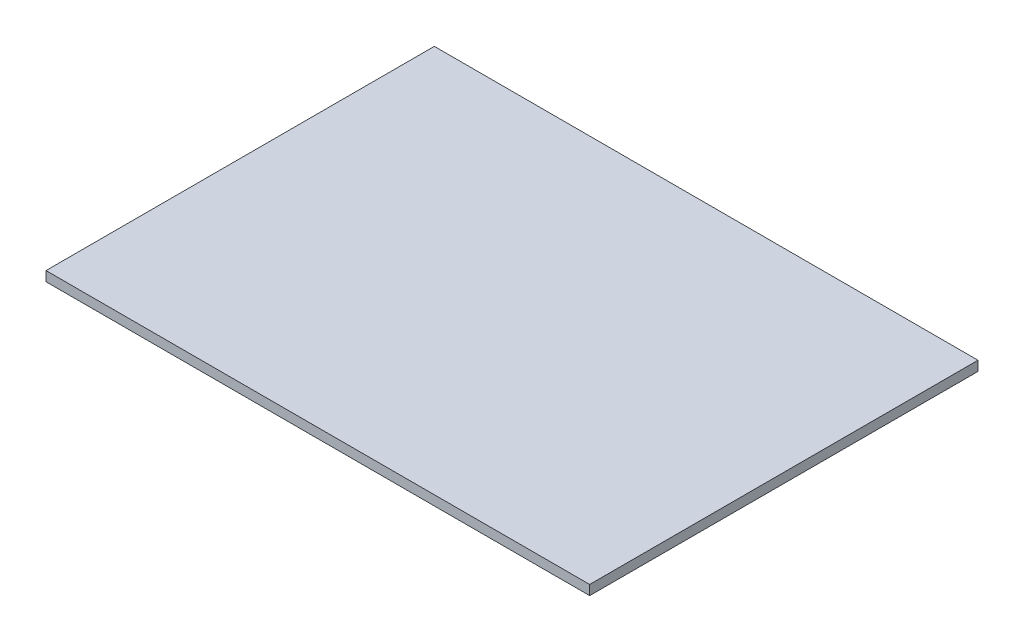
ISO-10303-21;
HEADER;
FILE_DESCRIPTION(('STEP AP214'),'2;1');
FILE_NAME('part.step','',(''),(''),'','','');
FILE_SCHEMA(('AUTOMOTIVE_DESIGN { 1 0 10303 214 1 1 1 1 }'));
ENDSEC;
DATA;
#1=APPLICATION_CONTEXT('core data for automotive mechanical design processes');
#2=APPLICATION_PROTOCOL_DEFINITION('international standard','automotive_design',2000,#1);
#3=PRODUCT_CONTEXT('',#1,'mechanical');
#4=PRODUCT('Part','Part','',(#3));
#5=PRODUCT_RELATED_PRODUCT_CATEGORY('part','',(#4));
#6=PRODUCT_DEFINITION_FORMATION('','',#4);
#7=PRODUCT_DEFINITION_CONTEXT('part definition',#1,'design');
#8=PRODUCT_DEFINITION('design','',#6,#7);
#9=PRODUCT_DEFINITION_SHAPE('','',#8);
#10=(LENGTH_UNIT() NAMED_UNIT(*) SI_UNIT(.MILLI.,.METRE.));
#11=(NAMED_UNIT(*) PLANE_ANGLE_UNIT() SI_UNIT($,.RADIAN.));
#12=(NAMED_UNIT(*) SI_UNIT($,.STERADIAN.) SOLID_ANGLE_UNIT());
#13=UNCERTAINTY_MEASURE_WITH_UNIT(LENGTH_MEASURE(1.E-05),#10,'distance_accuracy_value','');
#14=(GEOMETRIC_REPRESENTATION_CONTEXT(3) GLOBAL_UNCERTAINTY_ASSIGNED_CONTEXT((#13)) GLOBAL_UNIT_ASSIGNED_CONTEXT((#10,
#11,#12)) REPRESENTATION_CONTEXT('',''));
#15=CARTESIAN_POINT('',(0.,0.,0.));
#16=DIRECTION('',(0.,0.,1.));
#17=DIRECTION('',(1.,0.,0.));
#18=AXIS2_PLACEMENT_3D('',#15,#16,#17);
#19=CARTESIAN_POINT('',(0.,6.35,0.));
#20=DIRECTION('',(1.,0.,0.));
#21=DIRECTION('',(0.,0.,-1.));
#22=AXIS2_PLACEMENT_3D('',#19,#20,#21);
#23=PLANE('',#22);
#24=DIRECTION('',(0.,0.,1.));
#25=VECTOR('',#24,1.);
#26=CARTESIAN_POINT('',(0.,0.,0.));
#27=LINE('',#26,#25);
#28=CARTESIAN_POINT('',(0.,0.,-254.));
#29=VERTEX_POINT('',#28);
#30=CARTESIAN_POINT('',(0.,0.,0.));
#31=VERTEX_POINT('',#30);
#32=EDGE_CURVE('E96',#29,#31,#27,.T.);
#33=ORIENTED_EDGE('',*,*,#32,.T.);
#34=DIRECTION('',(0.,-1.,0.));
#35=VECTOR('',#34,1.);
#36=CARTESIAN_POINT('',(0.,6.35,0.));
#37=LINE('',#36,#35);
#38=CARTESIAN_POINT('',(0.,6.35,0.));
#39=VERTEX_POINT('',#38);
#40=EDGE_CURVE('E11',#39,#31,#37,.T.);
#41=ORIENTED_EDGE('',*,*,#40,.F.);
#42=DIRECTION('',(0.,0.,1.));
#43=VECTOR('',#42,1.);
#44=CARTESIAN_POINT('',(0.,6.35,0.));
#45=LINE('',#44,#43);
#46=CARTESIAN_POINT('',(0.,6.35,-254.));
#47=VERTEX_POINT('',#46);
#48=EDGE_CURVE('E84',#47,#39,#45,.T.);
#49=ORIENTED_EDGE('',*,*,#48,.F.);
#50=DIRECTION('',(0.,-1.,0.));
#51=VECTOR('',#50,1.);
#52=CARTESIAN_POINT('',(0.,6.35,-254.));
#53=LINE('',#52,#51);
#54=EDGE_CURVE('E92',#47,#29,#53,.T.);
#55=ORIENTED_EDGE('',*,*,#54,.T.);
#56=EDGE_LOOP('',(#33,#41,#49,#55));
#57=FACE_BOUND('',#56,.T.);
#58=ADVANCED_FACE('F33',(#57),#23,.F.);
#59=CARTESIAN_POINT('',(0.,6.35,0.));
#60=DIRECTION('',(0.,0.,-1.));
#61=DIRECTION('',(-1.,0.,0.));
#62=AXIS2_PLACEMENT_3D('',#59,#60,#61);
#63=PLANE('',#62);
#64=DIRECTION('',(1.,0.,0.));
#65=VECTOR('',#64,1.);
#66=CARTESIAN_POINT('',(0.,0.,0.));
#67=LINE('',#66,#65);
#68=CARTESIAN_POINT('',(355.6,0.,0.));
#69=VERTEX_POINT('',#68);
#70=EDGE_CURVE('E88',#31,#69,#67,.T.);
#71=ORIENTED_EDGE('',*,*,#70,.T.);
#72=DIRECTION('',(0.,-1.,0.));
#73=VECTOR('',#72,1.);
#74=CARTESIAN_POINT('',(355.6,6.35,0.));
#75=LINE('',#74,#73);
#76=CARTESIAN_POINT('',(355.6,6.35,0.));
#77=VERTEX_POINT('',#76);
#78=EDGE_CURVE('E41',#77,#69,#75,.T.);
#79=ORIENTED_EDGE('',*,*,#78,.F.);
#80=DIRECTION('',(1.,0.,0.));
#81=VECTOR('',#80,1.);
#82=CARTESIAN_POINT('',(0.,6.35,0.));
#83=LINE('',#82,#81);
#84=EDGE_CURVE('E79',#39,#77,#83,.T.);
#85=ORIENTED_EDGE('',*,*,#84,.F.);
#86=ORIENTED_EDGE('',*,*,#40,.T.);
#87=EDGE_LOOP('',(#71,#79,#85,#86));
#88=FACE_BOUND('',#87,.T.);
#89=ADVANCED_FACE('F87',(#88),#63,.F.);
#90=CARTESIAN_POINT('',(355.6,6.35,0.));
#91=DIRECTION('',(-1.,0.,0.));
#92=DIRECTION('',(0.,0.,1.));
#93=AXIS2_PLACEMENT_3D('',#90,#91,#92);
#94=PLANE('',#93);
#95=DIRECTION('',(0.,0.,-1.));
#96=VECTOR('',#95,1.);
#97=CARTESIAN_POINT('',(355.6,0.,0.));
#98=LINE('',#97,#96);
#99=CARTESIAN_POINT('',(355.6,0.,-254.));
#100=VERTEX_POINT('',#99);
#101=EDGE_CURVE('E66',#69,#100,#98,.T.);
#102=ORIENTED_EDGE('',*,*,#101,.T.);
#103=DIRECTION('',(0.,-1.,0.));
#104=VECTOR('',#103,1.);
#105=CARTESIAN_POINT('',(355.6,6.35,-254.));
#106=LINE('',#105,#104);
#107=CARTESIAN_POINT('',(355.6,6.35,-254.));
#108=VERTEX_POINT('',#107);
#109=EDGE_CURVE('E89',#108,#100,#106,.T.);
#110=ORIENTED_EDGE('',*,*,#109,.F.);
#111=DIRECTION('',(0.,0.,-1.));
#112=VECTOR('',#111,1.);
#113=CARTESIAN_POINT('',(355.6,6.35,0.));
#114=LINE('',#113,#112);
#115=EDGE_CURVE('E82',#77,#108,#114,.T.);
#116=ORIENTED_EDGE('',*,*,#115,.F.);
#117=ORIENTED_EDGE('',*,*,#78,.T.);
#118=EDGE_LOOP('',(#102,#110,#116,#117));
#119=FACE_BOUND('',#118,.T.);
#120=ADVANCED_FACE('F90',(#119),#94,.F.);
#121=CARTESIAN_POINT('',(0.,6.35,-254.));
#122=DIRECTION('',(0.,0.,1.));
#123=DIRECTION('',(1.,0.,0.));
#124=AXIS2_PLACEMENT_3D('',#121,#122,#123);
#125=PLANE('',#124);
#126=DIRECTION('',(-1.,0.,0.));
#127=VECTOR('',#126,1.);
#128=CARTESIAN_POINT('',(0.,0.,-254.));
#129=LINE('',#128,#127);
#130=EDGE_CURVE('E72',#100,#29,#129,.T.);
#131=ORIENTED_EDGE('',*,*,#130,.T.);
#132=ORIENTED_EDGE('',*,*,#54,.F.);
#133=DIRECTION('',(-1.,0.,0.));
#134=VECTOR('',#133,1.);
#135=CARTESIAN_POINT('',(0.,6.35,-254.));
#136=LINE('',#135,#134);
#137=EDGE_CURVE('E49',#108,#47,#136,.T.);
#138=ORIENTED_EDGE('',*,*,#137,.F.);
#139=ORIENTED_EDGE('',*,*,#109,.T.);
#140=EDGE_LOOP('',(#131,#132,#138,#139));
#141=FACE_BOUND('',#140,.T.);
#142=ADVANCED_FACE('F103',(#141),#125,.F.);
#143=CARTESIAN_POINT('',(0.,6.35,0.));
#144=DIRECTION('',(0.,-1.,0.));
#145=DIRECTION('',(0.,0.,-1.));
#146=AXIS2_PLACEMENT_3D('',#143,#144,#145);
#147=PLANE('',#146);
#148=ORIENTED_EDGE('',*,*,#48,.T.);
#149=ORIENTED_EDGE('',*,*,#84,.T.);
#150=ORIENTED_EDGE('',*,*,#115,.T.);
#151=ORIENTED_EDGE('',*,*,#137,.T.);
#152=EDGE_LOOP('',(#148,#149,#150,#151));
#153=FACE_BOUND('',#152,.T.);
#154=ADVANCED_FACE('F80',(#153),#147,.F.);
#155=CARTESIAN_POINT('',(0.,0.,0.));
#156=DIRECTION('',(0.,-1.,0.));
#157=DIRECTION('',(0.,0.,-1.));
#158=AXIS2_PLACEMENT_3D('',#155,#156,#157);
#159=PLANE('',#158);
#160=ORIENTED_EDGE('',*,*,#32,.F.);
#161=ORIENTED_EDGE('',*,*,#130,.F.);
#162=ORIENTED_EDGE('',*,*,#101,.F.);
#163=ORIENTED_EDGE('',*,*,#70,.F.);
#164=EDGE_LOOP('',(#160,#161,#162,#163));
#165=FACE_BOUND('',#164,.T.);
#166=ADVANCED_FACE('F106',(#165),#159,.T.);
#167=CLOSED_SHELL('',(#58,#89,#120,#142,#154,#166));
#168=MANIFOLD_SOLID_BREP('B2',#167);
#169=ADVANCED_BREP_SHAPE_REPRESENTATION('',(#18,#168),#14);
#170=SHAPE_DEFINITION_REPRESENTATION(#9,#169);
ENDSEC;
END-ISO-10303-21;
